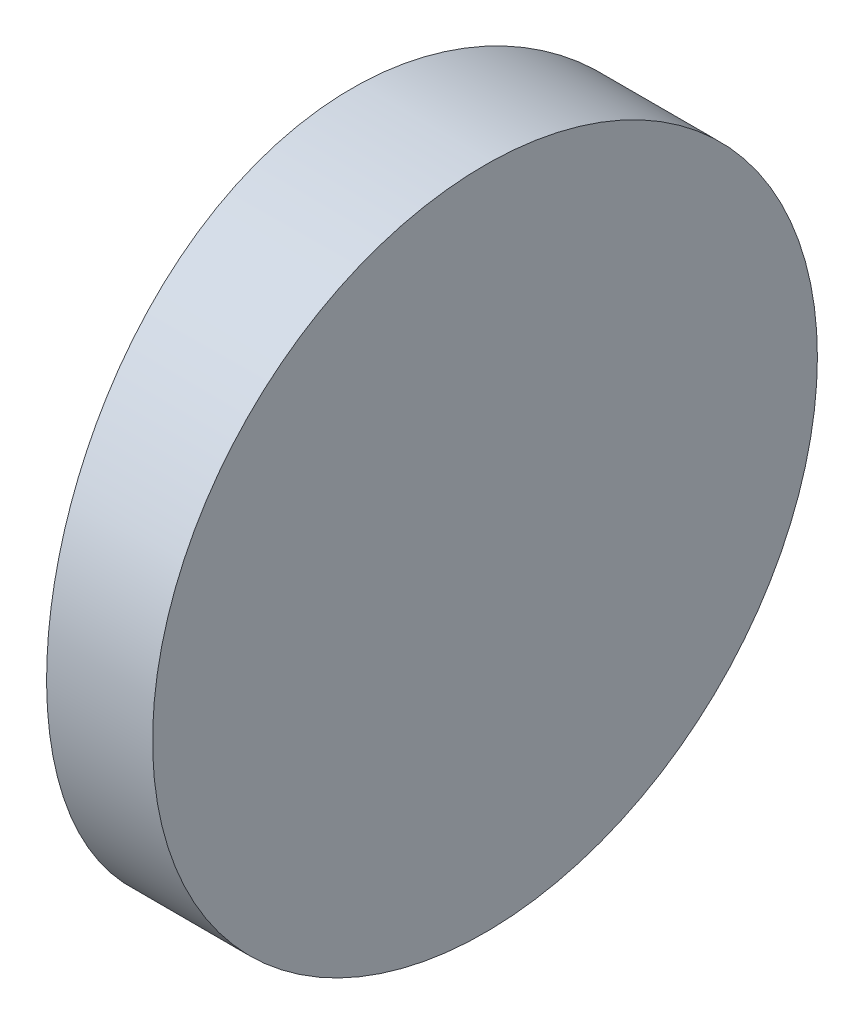
ISO-10303-21;
HEADER;
FILE_DESCRIPTION(('STEP AP214'),'2;1');
FILE_NAME('part.step','',(''),(''),'','','');
FILE_SCHEMA(('AUTOMOTIVE_DESIGN { 1 0 10303 214 1 1 1 1 }'));
ENDSEC;
DATA;
#1=APPLICATION_CONTEXT('core data for automotive mechanical design processes');
#2=APPLICATION_PROTOCOL_DEFINITION('international standard','automotive_design',2000,#1);
#3=PRODUCT_CONTEXT('',#1,'mechanical');
#4=PRODUCT('Part','Part','',(#3));
#5=PRODUCT_RELATED_PRODUCT_CATEGORY('part','',(#4));
#6=PRODUCT_DEFINITION_FORMATION('','',#4);
#7=PRODUCT_DEFINITION_CONTEXT('part definition',#1,'design');
#8=PRODUCT_DEFINITION('design','',#6,#7);
#9=PRODUCT_DEFINITION_SHAPE('','',#8);
#10=(LENGTH_UNIT() NAMED_UNIT(*) SI_UNIT(.MILLI.,.METRE.));
#11=(NAMED_UNIT(*) PLANE_ANGLE_UNIT() SI_UNIT($,.RADIAN.));
#12=(NAMED_UNIT(*) SI_UNIT($,.STERADIAN.) SOLID_ANGLE_UNIT());
#13=UNCERTAINTY_MEASURE_WITH_UNIT(LENGTH_MEASURE(1.E-05),#10,'distance_accuracy_value','');
#14=(GEOMETRIC_REPRESENTATION_CONTEXT(3) GLOBAL_UNCERTAINTY_ASSIGNED_CONTEXT((#13)) GLOBAL_UNIT_ASSIGNED_CONTEXT((#10,
#11,#12)) REPRESENTATION_CONTEXT('',''));
#15=CARTESIAN_POINT('',(0.,0.,0.));
#16=DIRECTION('',(0.,0.,1.));
#17=DIRECTION('',(1.,0.,0.));
#18=AXIS2_PLACEMENT_3D('',#15,#16,#17);
#19=CARTESIAN_POINT('',(4.35520433485127,12.5,0.));
#20=DIRECTION('',(0.,-1.,0.));
#21=DIRECTION('',(0.,0.,-1.));
#22=AXIS2_PLACEMENT_3D('',#19,#20,#21);
#23=CYLINDRICAL_SURFACE('',#22,38.78);
#24=CARTESIAN_POINT('',(-34.4247956651487,0.,0.));
#25=CARTESIAN_POINT('',(-34.4247965285953,-2.05185509478555E-06,-0.174366525234169));
#26=CARTESIAN_POINT('',(-34.4236173533267,0.00729961867458385,-0.348703493893497));
#27=CARTESIAN_POINT('',(-34.4189353406221,0.0364482854221283,-0.696181054581888));
#28=CARTESIAN_POINT('',(-34.4154319751068,0.0582985872378866,-0.869321365682935));
#29=CARTESIAN_POINT('',(-34.4061950338388,0.116403994978476,-1.21323561724376));
#30=CARTESIAN_POINT('',(-34.4004597935636,0.152669852396166,-1.38400769280864));
#31=CARTESIAN_POINT('',(-34.3869179084016,0.239345488391193,-1.72190722802995));
#32=CARTESIAN_POINT('',(-34.3791105007831,0.289760475430341,-1.88903332109492));
#33=CARTESIAN_POINT('',(-34.361654102646,0.404281647445358,-2.21819915901147));
#34=CARTESIAN_POINT('',(-34.3520073463583,0.468371233206289,-2.38024479977467));
#35=CARTESIAN_POINT('',(-34.3311302575816,0.609833601043833,-2.69839627791608));
#36=CARTESIAN_POINT('',(-34.3198993336787,0.687211346317343,-2.85449986919705));
#37=CARTESIAN_POINT('',(-34.2961747335016,0.854625830721126,-3.15953933554017));
#38=CARTESIAN_POINT('',(-34.283681823663,0.944654899228076,-3.30847948096304));
#39=CARTESIAN_POINT('',(-34.2577660867034,1.13681617075317,-3.59834721014674));
#40=CARTESIAN_POINT('',(-34.2443428385711,1.23895386841048,-3.7392711130527));
#41=CARTESIAN_POINT('',(-34.2168321795575,1.45544928357358,-4.0131654301689));
#42=CARTESIAN_POINT('',(-34.2027403400957,1.56989762130092,-4.14606377817746));
#43=CARTESIAN_POINT('',(-34.1743932133112,1.80949022789671,-4.40170985010413));
#44=CARTESIAN_POINT('',(-34.1601380012881,1.93462972823347,-4.52446205189083));
#45=CARTESIAN_POINT('',(-34.1318476493633,2.1948785862998,-4.75911855893521));
#46=CARTESIAN_POINT('',(-34.1178126682692,2.32999477064233,-4.87101531284098));
#47=CARTESIAN_POINT('',(-34.0903737153556,2.60914119266096,-5.08304591977677));
#48=CARTESIAN_POINT('',(-34.0769695092637,2.75316807412297,-5.18318416096067));
#49=CARTESIAN_POINT('',(-34.0510819259909,3.05016468307349,-5.37165592044536));
#50=CARTESIAN_POINT('',(-34.0386051609979,3.20318684366729,-5.45990775362748));
#51=CARTESIAN_POINT('',(-34.0150361045467,3.51617630017746,-5.62315308445156));
#52=CARTESIAN_POINT('',(-34.0039433013615,3.67614099938923,-5.69815148691479));
#53=CARTESIAN_POINT('',(-33.9834690535753,4.00181068451241,-5.83431789589335));
#54=CARTESIAN_POINT('',(-33.9740862268381,4.16751090445207,-5.8954970818403));
#55=CARTESIAN_POINT('',(-33.9572987250518,4.50352976892727,-6.00362349371565));
#56=CARTESIAN_POINT('',(-33.9498935688703,4.67384727903073,-6.05057418156215));
#57=CARTESIAN_POINT('',(-33.9351600758124,5.07578182063516,-6.14323415428353));
#58=CARTESIAN_POINT('',(-33.9286931326951,5.30877184866034,-6.1832285736781));
#59=CARTESIAN_POINT('',(-33.9200335870237,5.77785933695091,-6.23660993552083));
#60=CARTESIAN_POINT('',(-33.917840929825,6.01395675745106,-6.24999721812734));
#61=CARTESIAN_POINT('',(-33.9178387985652,6.42434999588606,-6.2500020547908));
#62=CARTESIAN_POINT('',(-33.9190335005835,6.59867043320914,-6.24270175503963));
#63=CARTESIAN_POINT('',(-33.9237757603343,6.94611448305919,-6.2135586980447));
#64=CARTESIAN_POINT('',(-33.9273238531183,7.11923781437389,-6.19171263376699));
#65=CARTESIAN_POINT('',(-33.9366744584473,7.4631177180967,-6.13361882061224));
#66=CARTESIAN_POINT('',(-33.9424786573518,7.63387242092579,-6.09736029847388));
#67=CARTESIAN_POINT('',(-33.9561748580055,7.97173683885677,-6.01070276416264));
#68=CARTESIAN_POINT('',(-33.9640676290131,8.13884518634253,-5.96029854146059));
#69=CARTESIAN_POINT('',(-33.9817012600132,8.46797328361112,-5.84580335959151));
#70=CARTESIAN_POINT('',(-33.9914398480159,8.62999900672886,-5.78172921448389));
#71=CARTESIAN_POINT('',(-34.0124970438001,8.94811234840627,-5.64030147489918));
#72=CARTESIAN_POINT('',(-34.0238162417416,9.10419772115953,-5.56294291786595));
#73=CARTESIAN_POINT('',(-34.0477039524392,9.40920398071697,-5.39556975413756));
#74=CARTESIAN_POINT('',(-34.0602717086601,9.55812912588467,-5.30556279790781));
#75=CARTESIAN_POINT('',(-34.0863155182637,9.84797095021448,-5.11344779550113));
#76=CARTESIAN_POINT('',(-34.0997919828611,9.988883949778,-5.01133425470784));
#77=CARTESIAN_POINT('',(-34.127385057283,10.2627930400981,-4.79486306431769));
#78=CARTESIAN_POINT('',(-34.1415060001481,10.3957149807941,-4.680412131));
#79=CARTESIAN_POINT('',(-34.1698804182118,10.651408429201,-4.44080935628091));
#80=CARTESIAN_POINT('',(-34.18413383181,10.7741844155769,-4.31566228657387));
#81=CARTESIAN_POINT('',(-34.2123899007706,11.0088875162179,-4.05539353232647));
#82=CARTESIAN_POINT('',(-34.2263923769189,11.1208071105635,-3.92026504646358));
#83=CARTESIAN_POINT('',(-34.2537393026801,11.3328816234979,-3.64108936855733));
#84=CARTESIAN_POINT('',(-34.2670839968814,11.4330409344527,-3.49704553721371));
#85=CARTESIAN_POINT('',(-34.2928296304788,11.6215366648111,-3.20003538970522));
#86=CARTESIAN_POINT('',(-34.3052239927285,11.7097934266893,-3.04701792991795));
#87=CARTESIAN_POINT('',(-34.3286172767744,11.8730491083368,-2.73403745358415));
#88=CARTESIAN_POINT('',(-34.3396167143328,11.9480529323312,-2.57407703367714));
#89=CARTESIAN_POINT('',(-34.3599039635727,12.0842305113883,-2.24841595255627));
#90=CARTESIAN_POINT('',(-34.3691931535882,12.1454154125853,-2.08272004281949));
#91=CARTESIAN_POINT('',(-34.3858037439413,12.2535534376543,-1.74671076313006));
#92=CARTESIAN_POINT('',(-34.3931256220992,12.3005100176526,-1.57639852547327));
#93=CARTESIAN_POINT('',(-34.4076898106766,12.3931957772945,-1.17442801863431));
#94=CARTESIAN_POINT('',(-34.4140777576383,12.4332046661591,-0.941395868663685));
#95=CARTESIAN_POINT('',(-34.4226300745571,12.4866052259702,-0.472224392732396));
#96=CARTESIAN_POINT('',(-34.4247944960776,12.4999972218726,-0.236085104741087));
#97=CARTESIAN_POINT('',(-34.4247965285953,12.5000020518551,0.174366525234195));
#98=CARTESIAN_POINT('',(-34.4236173533267,12.4927003813254,0.348703493893522));
#99=CARTESIAN_POINT('',(-34.4189353406221,12.4635517145779,0.696181054581914));
#100=CARTESIAN_POINT('',(-34.4154319751068,12.4417014127621,0.869321365682961));
#101=CARTESIAN_POINT('',(-34.4061950338388,12.3835960050215,1.21323561724379));
#102=CARTESIAN_POINT('',(-34.4004597935636,12.3473301476038,1.38400769280867));
#103=CARTESIAN_POINT('',(-34.3869179084016,12.2606545116088,1.72190722802998));
#104=CARTESIAN_POINT('',(-34.3791105007831,12.2102395245697,1.88903332109495));
#105=CARTESIAN_POINT('',(-34.361654102646,12.0957183525546,2.2181991590115));
#106=CARTESIAN_POINT('',(-34.3520073463583,12.0316287667937,2.3802447997747));
#107=CARTESIAN_POINT('',(-34.3311302575816,11.8901663989562,2.69839627791611));
#108=CARTESIAN_POINT('',(-34.3198993336787,11.8127886536827,2.85449986919707));
#109=CARTESIAN_POINT('',(-34.2961747335016,11.6453741692789,3.1595393355402));
#110=CARTESIAN_POINT('',(-34.283681823663,11.5553451007719,3.30847948096306));
#111=CARTESIAN_POINT('',(-34.2577660867034,11.3631838292468,3.59834721014676));
#112=CARTESIAN_POINT('',(-34.2443428385711,11.2610461315895,3.73927111305272));
#113=CARTESIAN_POINT('',(-34.2168321795575,11.0445507164264,4.01316543016892));
#114=CARTESIAN_POINT('',(-34.2027403400957,10.9301023786991,4.14606377817749));
#115=CARTESIAN_POINT('',(-34.1743932133112,10.6905097721033,4.40170985010415));
#116=CARTESIAN_POINT('',(-34.1601380012881,10.5653702717665,4.52446205189085));
#117=CARTESIAN_POINT('',(-34.1318476493633,10.3051214137002,4.75911855893524));
#118=CARTESIAN_POINT('',(-34.1178126682692,10.1700052293577,4.87101531284101));
#119=CARTESIAN_POINT('',(-34.0903737153556,9.89085880733904,5.0830459197768));
#120=CARTESIAN_POINT('',(-34.0769695092637,9.74683192587702,5.1831841609607));
#121=CARTESIAN_POINT('',(-34.0510819259909,9.44983531692651,5.37165592044539));
#122=CARTESIAN_POINT('',(-34.0386051609979,9.29681315633271,5.45990775362751));
#123=CARTESIAN_POINT('',(-34.0150361045467,8.98382369982254,5.62315308445159));
#124=CARTESIAN_POINT('',(-34.0039433013615,8.82385900061077,5.69815148691482));
#125=CARTESIAN_POINT('',(-33.9834690535753,8.49818931548759,5.83431789589338));
#126=CARTESIAN_POINT('',(-33.9740862268381,8.33248909554793,5.89549708184032));
#127=CARTESIAN_POINT('',(-33.9572987250518,7.99647023107273,6.00362349371567));
#128=CARTESIAN_POINT('',(-33.9498935688703,7.82615272096926,6.05057418156218));
#129=CARTESIAN_POINT('',(-33.9351600758124,7.42421817936483,6.14323415428355));
#130=CARTESIAN_POINT('',(-33.9286931326951,7.19122815133965,6.18322857367813));
#131=CARTESIAN_POINT('',(-33.9200335870237,6.72214066304909,6.23660993552086));
#132=CARTESIAN_POINT('',(-33.917840929825,6.48604324254894,6.24999721812736));
#133=CARTESIAN_POINT('',(-33.9178387985652,6.07565000411394,6.25000205479082));
#134=CARTESIAN_POINT('',(-33.9190335005835,5.90132956679086,6.24270175503966));
#135=CARTESIAN_POINT('',(-33.9237757603343,5.55388551694081,6.21355869804472));
#136=CARTESIAN_POINT('',(-33.9273238531183,5.38076218562611,6.19171263376702));
#137=CARTESIAN_POINT('',(-33.9366744584473,5.0368822819033,6.13361882061227));
#138=CARTESIAN_POINT('',(-33.9424786573518,4.86612757907421,6.09736029847391));
#139=CARTESIAN_POINT('',(-33.9561748580055,4.52826316114323,6.01070276416267));
#140=CARTESIAN_POINT('',(-33.964067629013,4.36115481365747,5.96029854146061));
#141=CARTESIAN_POINT('',(-33.9817012600132,4.03202671638888,5.84580335959154));
#142=CARTESIAN_POINT('',(-33.9914398480159,3.87000099327114,5.78172921448392));
#143=CARTESIAN_POINT('',(-34.0124970438001,3.55188765159372,5.64030147489921));
#144=CARTESIAN_POINT('',(-34.0238162417416,3.39580227884047,5.56294291786597));
#145=CARTESIAN_POINT('',(-34.0477039524392,3.09079601928303,5.39556975413758));
#146=CARTESIAN_POINT('',(-34.0602717086601,2.94187087411533,5.30556279790784));
#147=CARTESIAN_POINT('',(-34.0863155182637,2.65202904978552,5.11344779550115));
#148=CARTESIAN_POINT('',(-34.0997919828611,2.511116050222,5.01133425470787));
#149=CARTESIAN_POINT('',(-34.127385057283,2.23720695990189,4.79486306431772));
#150=CARTESIAN_POINT('',(-34.1415060001481,2.10428501920586,4.68041213100002));
#151=CARTESIAN_POINT('',(-34.1698804182118,1.84859157079897,4.44080935628093));
#152=CARTESIAN_POINT('',(-34.18413383181,1.72581558442314,4.3156622865739));
#153=CARTESIAN_POINT('',(-34.2123899007706,1.49111248378211,4.0553935323265));
#154=CARTESIAN_POINT('',(-34.2263923769189,1.37919288943649,3.92026504646361));
#155=CARTESIAN_POINT('',(-34.2537393026801,1.16711837650211,3.64108936855736));
#156=CARTESIAN_POINT('',(-34.2670839968814,1.0669590655473,3.49704553721373));
#157=CARTESIAN_POINT('',(-34.2928296304788,0.878463335188944,3.20003538970524));
#158=CARTESIAN_POINT('',(-34.3052239927285,0.79020657331071,3.04701792991797));
#159=CARTESIAN_POINT('',(-34.3286172767744,0.62695089166319,2.73403745358417));
#160=CARTESIAN_POINT('',(-34.3396167143328,0.551947067668794,2.57407703367717));
#161=CARTESIAN_POINT('',(-34.3599039635727,0.415769488611736,2.2484159525563));
#162=CARTESIAN_POINT('',(-34.3691931535882,0.354584587414676,2.08272004281952));
#163=CARTESIAN_POINT('',(-34.3858037439413,0.246446562345656,1.74671076313009));
#164=CARTESIAN_POINT('',(-34.3931256220992,0.199489982347417,1.57639852547329));
#165=CARTESIAN_POINT('',(-34.4076898106766,0.106804222705532,1.17442801863433));
#166=CARTESIAN_POINT('',(-34.4140777576383,0.0667953338408689,0.941395868663709));
#167=CARTESIAN_POINT('',(-34.4226300745571,0.0133947740298298,0.472224392732421));
#168=CARTESIAN_POINT('',(-34.4247944960776,2.77812742047485E-06,0.236085104741114));
#169=CARTESIAN_POINT('',(-34.4247956651487,0.,0.));
#170=B_SPLINE_CURVE_WITH_KNOTS('',3,(#24,#25,#26,#27,#28,#29,#30,#31,#32,#33,#34,#35,#36,#37,
#38,#39,#40,#41,#42,#43,#44,#45,#46,#47,#48,#49,#50,#51,#52,#53,#54,#55,#56,#57,#58,#59,#60,#61,
#62,#63,#64,#65,#66,#67,#68,#69,#70,#71,#72,#73,#74,#75,#76,#77,#78,#79,#80,#81,#82,#83,#84,#85,
#86,#87,#88,#89,#90,#91,#92,#93,#94,#95,#96,#97,#98,#99,#100,#101,#102,#103,#104,#105,#106,#107,
#108,#109,#110,#111,#112,#113,#114,#115,#116,#117,#118,#119,#120,#121,#122,#123,#124,#125,#126,
#127,#128,#129,#130,#131,#132,#133,#134,#135,#136,#137,#138,#139,#140,#141,#142,#143,#144,#145,
#146,#147,#148,#149,#150,#151,#152,#153,#154,#155,#156,#157,#158,#159,#160,#161,#162,#163,#164,
#165,#166,#167,#168,#169),.UNSPECIFIED.,.T.,.F.,(4,2,2,2,2,2,2,2,2,2,2,2,2,2,2,2,2,2,2,2,2,2,2,
2,2,2,2,2,2,2,2,2,2,2,2,2,2,2,2,2,2,2,2,2,2,2,2,2,2,2,2,2,2,2,2,2,2,2,2,2,2,2,2,2,2,2,2,2,2,2,2,
2,4),(0.,0.522892037742021,1.04590292246562,1.56930461629451,2.09289923375462,2.6158618538615,
3.13902022976285,3.66186276723491,4.18494347429848,4.71217904097484,5.23918066270134,
5.76654629156655,6.29371448336641,6.82433835982629,7.35476545020667,7.88476188796563,
8.41462926923028,9.12248699094145,9.83033566300328,10.3531780529367,10.8761393536498,
11.3994923034332,11.9230382824002,12.4459439726095,12.9690454273238,13.49183183183,
14.0148564196765,14.5421573489807,15.0692242577743,15.596653682415,16.1238854857716,
16.6544870863181,17.1848919256371,17.7148674083183,18.2447140540682,18.9526970139888,
19.6606713303481,20.1835633680901,20.7065742528137,21.2299759466426,21.7535705641027,
22.2765331842096,22.7996915601109,23.322534097583,23.8456148046465,24.3728503713229,
24.8998519930494,25.4272176219146,25.9543858137145,26.4850096901744,27.0154367805547,
27.5454332183137,28.0753005995783,28.7831583212895,29.4910069933513,30.0138493832848,
30.5368106839979,31.0601636337813,31.5837096127483,32.1066153029575,32.6297167576719,
33.1525031621781,33.6755277500246,34.2028286793288,34.7298955881224,35.257325012763,
35.7845568161197,36.3151584166661,36.8455632559852,37.3755387386664,37.9053853844162,
38.6133683443368,39.3213426606961),.UNSPECIFIED.);
#171=CARTESIAN_POINT('',(-34.4247956651487,0.,0.));
#172=VERTEX_POINT('',#171);
#173=EDGE_CURVE('E11',#172,#172,#170,.T.);
#174=ORIENTED_EDGE('',*,*,#173,.F.);
#175=EDGE_LOOP('',(#174));
#176=FACE_BOUND('',#175,.T.);
#177=ADVANCED_FACE('F69',(#176),#23,.T.);
#178=CARTESIAN_POINT('',(-31.9247956651487,12.5,-6.25));
#179=DIRECTION('',(1.,0.,0.));
#180=DIRECTION('',(0.,0.,-1.));
#181=AXIS2_PLACEMENT_3D('',#178,#179,#180);
#182=PLANE('',#181);
#183=CARTESIAN_POINT('',(-31.9247956651487,6.25,0.));
#184=DIRECTION('',(1.,0.,0.));
#185=DIRECTION('',(0.,0.,-1.));
#186=AXIS2_PLACEMENT_3D('',#183,#184,#185);
#187=CIRCLE('',#186,6.25);
#188=CARTESIAN_POINT('',(-31.9247956651487,6.25,-6.24999999999999));
#189=VERTEX_POINT('',#188);
#190=EDGE_CURVE('E79',#189,#189,#187,.T.);
#191=ORIENTED_EDGE('',*,*,#190,.T.);
#192=EDGE_LOOP('',(#191));
#193=FACE_BOUND('',#192,.T.);
#194=ADVANCED_FACE('F71',(#193),#182,.T.);
#195=CARTESIAN_POINT('',(-44.6247956651487,6.25,0.));
#196=DIRECTION('',(1.,0.,0.));
#197=DIRECTION('',(0.,0.,-1.));
#198=AXIS2_PLACEMENT_3D('',#195,#196,#197);
#199=CYLINDRICAL_SURFACE('',#198,6.25);
#200=ORIENTED_EDGE('',*,*,#190,.F.);
#201=EDGE_LOOP('',(#200));
#202=FACE_BOUND('',#201,.T.);
#203=ORIENTED_EDGE('',*,*,#173,.T.);
#204=EDGE_LOOP('',(#203));
#205=FACE_BOUND('',#204,.T.);
#206=ADVANCED_FACE('F86',(#202,#205),#199,.T.);
#207=CLOSED_SHELL('',(#177,#194,#206));
#208=MANIFOLD_SOLID_BREP('B2',#207);
#209=ADVANCED_BREP_SHAPE_REPRESENTATION('',(#18,#208),#14);
#210=SHAPE_DEFINITION_REPRESENTATION(#9,#209);
ENDSEC;
END-ISO-10303-21;
